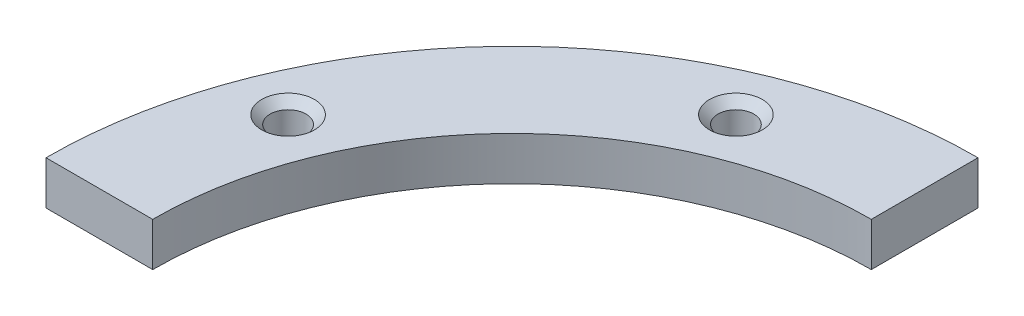
ISO-10303-21;
HEADER;
FILE_DESCRIPTION(('STEP AP214'),'2;1');
FILE_NAME('part.step','',(''),(''),'','','');
FILE_SCHEMA(('AUTOMOTIVE_DESIGN { 1 0 10303 214 1 1 1 1 }'));
ENDSEC;
DATA;
#1=APPLICATION_CONTEXT('core data for automotive mechanical design processes');
#2=APPLICATION_PROTOCOL_DEFINITION('international standard','automotive_design',2000,#1);
#3=PRODUCT_CONTEXT('',#1,'mechanical');
#4=PRODUCT('Part','Part','',(#3));
#5=PRODUCT_RELATED_PRODUCT_CATEGORY('part','',(#4));
#6=PRODUCT_DEFINITION_FORMATION('','',#4);
#7=PRODUCT_DEFINITION_CONTEXT('part definition',#1,'design');
#8=PRODUCT_DEFINITION('design','',#6,#7);
#9=PRODUCT_DEFINITION_SHAPE('','',#8);
#10=(LENGTH_UNIT() NAMED_UNIT(*) SI_UNIT(.MILLI.,.METRE.));
#11=(NAMED_UNIT(*) PLANE_ANGLE_UNIT() SI_UNIT($,.RADIAN.));
#12=(NAMED_UNIT(*) SI_UNIT($,.STERADIAN.) SOLID_ANGLE_UNIT());
#13=UNCERTAINTY_MEASURE_WITH_UNIT(LENGTH_MEASURE(1.E-05),#10,'distance_accuracy_value','');
#14=(GEOMETRIC_REPRESENTATION_CONTEXT(3) GLOBAL_UNCERTAINTY_ASSIGNED_CONTEXT((#13)) GLOBAL_UNIT_ASSIGNED_CONTEXT((#10,
#11,#12)) REPRESENTATION_CONTEXT('',''));
#15=CARTESIAN_POINT('',(0.,0.,0.));
#16=DIRECTION('',(0.,0.,1.));
#17=DIRECTION('',(1.,0.,0.));
#18=AXIS2_PLACEMENT_3D('',#15,#16,#17);
#19=CARTESIAN_POINT('',(0.,4.,0.));
#20=DIRECTION('',(0.,-1.,0.));
#21=DIRECTION('',(0.,0.,-1.));
#22=AXIS2_PLACEMENT_3D('',#19,#20,#21);
#23=CYLINDRICAL_SURFACE('',#22,33.);
#24=CARTESIAN_POINT('',(0.,0.,0.));
#25=DIRECTION('',(0.,-1.,0.));
#26=DIRECTION('',(0.,0.,-1.));
#27=AXIS2_PLACEMENT_3D('',#24,#25,#26);
#28=CIRCLE('',#27,33.);
#29=CARTESIAN_POINT('',(-33.,0.,0.));
#30=VERTEX_POINT('',#29);
#31=CARTESIAN_POINT('',(-1.23301553056196E-13,0.,-33.));
#32=VERTEX_POINT('',#31);
#33=EDGE_CURVE('E107',#30,#32,#28,.T.);
#34=ORIENTED_EDGE('',*,*,#33,.T.);
#35=DIRECTION('',(0.,-1.,0.));
#36=VECTOR('',#35,1.);
#37=CARTESIAN_POINT('',(-1.23301553056196E-13,4.,-33.));
#38=LINE('',#37,#36);
#39=CARTESIAN_POINT('',(-1.23301553056196E-13,4.,-33.));
#40=VERTEX_POINT('',#39);
#41=EDGE_CURVE('E11',#40,#32,#38,.T.);
#42=ORIENTED_EDGE('',*,*,#41,.F.);
#43=CARTESIAN_POINT('',(0.,4.,0.));
#44=DIRECTION('',(0.,-1.,0.));
#45=DIRECTION('',(0.,0.,-1.));
#46=AXIS2_PLACEMENT_3D('',#43,#44,#45);
#47=CIRCLE('',#46,33.);
#48=CARTESIAN_POINT('',(-33.,4.,0.));
#49=VERTEX_POINT('',#48);
#50=EDGE_CURVE('E95',#49,#40,#47,.T.);
#51=ORIENTED_EDGE('',*,*,#50,.F.);
#52=DIRECTION('',(0.,-1.,0.));
#53=VECTOR('',#52,1.);
#54=CARTESIAN_POINT('',(-33.,4.,0.));
#55=LINE('',#54,#53);
#56=EDGE_CURVE('E103',#49,#30,#55,.T.);
#57=ORIENTED_EDGE('',*,*,#56,.T.);
#58=EDGE_LOOP('',(#34,#42,#51,#57));
#59=FACE_BOUND('',#58,.T.);
#60=ADVANCED_FACE('F44',(#59),#23,.F.);
#61=CARTESIAN_POINT('',(-1.23301553056196E-13,4.,-33.));
#62=DIRECTION('',(-1.,0.,0.));
#63=DIRECTION('',(0.,0.,1.));
#64=AXIS2_PLACEMENT_3D('',#61,#62,#63);
#65=PLANE('',#64);
#66=DIRECTION('',(0.,0.,-1.));
#67=VECTOR('',#66,1.);
#68=CARTESIAN_POINT('',(-1.23301553056196E-13,0.,-33.));
#69=LINE('',#68,#67);
#70=CARTESIAN_POINT('',(0.,0.,-42.8));
#71=VERTEX_POINT('',#70);
#72=EDGE_CURVE('E99',#32,#71,#69,.T.);
#73=ORIENTED_EDGE('',*,*,#72,.T.);
#74=DIRECTION('',(0.,-1.,0.));
#75=VECTOR('',#74,1.);
#76=CARTESIAN_POINT('',(0.,4.,-42.8));
#77=LINE('',#76,#75);
#78=CARTESIAN_POINT('',(0.,4.,-42.8));
#79=VERTEX_POINT('',#78);
#80=EDGE_CURVE('E52',#79,#71,#77,.T.);
#81=ORIENTED_EDGE('',*,*,#80,.F.);
#82=DIRECTION('',(0.,0.,-1.));
#83=VECTOR('',#82,1.);
#84=CARTESIAN_POINT('',(-1.23301553056196E-13,4.,-33.));
#85=LINE('',#84,#83);
#86=EDGE_CURVE('E90',#40,#79,#85,.T.);
#87=ORIENTED_EDGE('',*,*,#86,.F.);
#88=ORIENTED_EDGE('',*,*,#41,.T.);
#89=EDGE_LOOP('',(#73,#81,#87,#88));
#90=FACE_BOUND('',#89,.T.);
#91=ADVANCED_FACE('F98',(#90),#65,.F.);
#92=CARTESIAN_POINT('',(0.,4.,0.));
#93=DIRECTION('',(0.,-1.,0.));
#94=DIRECTION('',(0.,0.,-1.));
#95=AXIS2_PLACEMENT_3D('',#92,#93,#94);
#96=CYLINDRICAL_SURFACE('',#95,42.8);
#97=CARTESIAN_POINT('',(0.,0.,0.));
#98=DIRECTION('',(0.,1.,0.));
#99=DIRECTION('',(0.,0.,-1.));
#100=AXIS2_PLACEMENT_3D('',#97,#98,#99);
#101=CIRCLE('',#100,42.8);
#102=CARTESIAN_POINT('',(-42.8,0.,0.));
#103=VERTEX_POINT('',#102);
#104=EDGE_CURVE('E77',#71,#103,#101,.T.);
#105=ORIENTED_EDGE('',*,*,#104,.T.);
#106=DIRECTION('',(0.,-1.,0.));
#107=VECTOR('',#106,1.);
#108=CARTESIAN_POINT('',(-42.8,4.,0.));
#109=LINE('',#108,#107);
#110=CARTESIAN_POINT('',(-42.8,4.,0.));
#111=VERTEX_POINT('',#110);
#112=EDGE_CURVE('E100',#111,#103,#109,.T.);
#113=ORIENTED_EDGE('',*,*,#112,.F.);
#114=CARTESIAN_POINT('',(0.,4.,0.));
#115=DIRECTION('',(0.,1.,0.));
#116=DIRECTION('',(0.,0.,-1.));
#117=AXIS2_PLACEMENT_3D('',#114,#115,#116);
#118=CIRCLE('',#117,42.8);
#119=EDGE_CURVE('E93',#79,#111,#118,.T.);
#120=ORIENTED_EDGE('',*,*,#119,.F.);
#121=ORIENTED_EDGE('',*,*,#80,.T.);
#122=EDGE_LOOP('',(#105,#113,#120,#121));
#123=FACE_BOUND('',#122,.T.);
#124=ADVANCED_FACE('F101',(#123),#96,.T.);
#125=CARTESIAN_POINT('',(-33.,4.,0.));
#126=DIRECTION('',(0.,0.,-1.));
#127=DIRECTION('',(-1.,0.,0.));
#128=AXIS2_PLACEMENT_3D('',#125,#126,#127);
#129=PLANE('',#128);
#130=DIRECTION('',(1.,0.,0.));
#131=VECTOR('',#130,1.);
#132=CARTESIAN_POINT('',(-33.,0.,0.));
#133=LINE('',#132,#131);
#134=EDGE_CURVE('E83',#103,#30,#133,.T.);
#135=ORIENTED_EDGE('',*,*,#134,.T.);
#136=ORIENTED_EDGE('',*,*,#56,.F.);
#137=DIRECTION('',(1.,0.,0.));
#138=VECTOR('',#137,1.);
#139=CARTESIAN_POINT('',(-33.,4.,0.));
#140=LINE('',#139,#138);
#141=EDGE_CURVE('E60',#111,#49,#140,.T.);
#142=ORIENTED_EDGE('',*,*,#141,.F.);
#143=ORIENTED_EDGE('',*,*,#112,.T.);
#144=EDGE_LOOP('',(#135,#136,#142,#143));
#145=FACE_BOUND('',#144,.T.);
#146=ADVANCED_FACE('F115',(#145),#129,.F.);
#147=CARTESIAN_POINT('',(0.,4.,0.));
#148=DIRECTION('',(0.,-1.,0.));
#149=DIRECTION('',(0.,0.,-1.));
#150=AXIS2_PLACEMENT_3D('',#147,#148,#149);
#151=PLANE('',#150);
#152=CARTESIAN_POINT('',(-14.5419704298741,4.,-35.1074222354286));
#153=DIRECTION('',(0.,1.,0.));
#154=DIRECTION('',(0.,0.,1.));
#155=AXIS2_PLACEMENT_3D('',#152,#153,#154);
#156=CIRCLE('',#155,2.425);
#157=CARTESIAN_POINT('',(-14.5419704298741,4.,-32.6824222354286));
#158=VERTEX_POINT('',#157);
#159=EDGE_CURVE('E135',#158,#158,#156,.T.);
#160=ORIENTED_EDGE('',*,*,#159,.F.);
#161=EDGE_LOOP('',(#160));
#162=FACE_BOUND('',#161,.T.);
#163=CARTESIAN_POINT('',(-35.107422235429,4.,-14.5419704298732));
#164=DIRECTION('',(0.,1.,0.));
#165=DIRECTION('',(0.,0.,1.));
#166=AXIS2_PLACEMENT_3D('',#163,#164,#165);
#167=CIRCLE('',#166,2.425);
#168=CARTESIAN_POINT('',(-35.107422235429,4.,-12.1169704298732));
#169=VERTEX_POINT('',#168);
#170=EDGE_CURVE('E126',#169,#169,#167,.T.);
#171=ORIENTED_EDGE('',*,*,#170,.F.);
#172=EDGE_LOOP('',(#171));
#173=FACE_BOUND('',#172,.T.);
#174=ORIENTED_EDGE('',*,*,#50,.T.);
#175=ORIENTED_EDGE('',*,*,#86,.T.);
#176=ORIENTED_EDGE('',*,*,#119,.T.);
#177=ORIENTED_EDGE('',*,*,#141,.T.);
#178=EDGE_LOOP('',(#174,#175,#176,#177));
#179=FACE_BOUND('',#178,.T.);
#180=ADVANCED_FACE('F91',(#162,#173,#179),#151,.F.);
#181=CARTESIAN_POINT('',(0.,0.,0.));
#182=DIRECTION('',(0.,-1.,0.));
#183=DIRECTION('',(0.,0.,-1.));
#184=AXIS2_PLACEMENT_3D('',#181,#182,#183);
#185=PLANE('',#184);
#186=CARTESIAN_POINT('',(-14.5419704298741,0.,-35.1074222354286));
#187=DIRECTION('',(0.,1.,0.));
#188=DIRECTION('',(0.,0.,1.));
#189=AXIS2_PLACEMENT_3D('',#186,#187,#188);
#190=CIRCLE('',#189,1.65);
#191=CARTESIAN_POINT('',(-14.5419704298741,0.,-33.4574222354286));
#192=VERTEX_POINT('',#191);
#193=EDGE_CURVE('E129',#192,#192,#190,.T.);
#194=ORIENTED_EDGE('',*,*,#193,.T.);
#195=EDGE_LOOP('',(#194));
#196=FACE_BOUND('',#195,.T.);
#197=CARTESIAN_POINT('',(-35.107422235429,0.,-14.5419704298732));
#198=DIRECTION('',(0.,1.,0.));
#199=DIRECTION('',(0.,0.,1.));
#200=AXIS2_PLACEMENT_3D('',#197,#198,#199);
#201=CIRCLE('',#200,1.65);
#202=CARTESIAN_POINT('',(-35.107422235429,0.,-12.8919704298732));
#203=VERTEX_POINT('',#202);
#204=EDGE_CURVE('E110',#203,#203,#201,.T.);
#205=ORIENTED_EDGE('',*,*,#204,.T.);
#206=EDGE_LOOP('',(#205));
#207=FACE_BOUND('',#206,.T.);
#208=ORIENTED_EDGE('',*,*,#33,.F.);
#209=ORIENTED_EDGE('',*,*,#134,.F.);
#210=ORIENTED_EDGE('',*,*,#104,.F.);
#211=ORIENTED_EDGE('',*,*,#72,.F.);
#212=EDGE_LOOP('',(#208,#209,#210,#211));
#213=FACE_BOUND('',#212,.T.);
#214=ADVANCED_FACE('F118',(#196,#207,#213),#185,.T.);
#215=CARTESIAN_POINT('',(-35.107422235429,4.,-14.5419704298732));
#216=DIRECTION('',(0.,1.,0.));
#217=DIRECTION('',(0.,0.,1.));
#218=AXIS2_PLACEMENT_3D('',#215,#216,#217);
#219=CYLINDRICAL_SURFACE('',#218,1.65);
#220=ORIENTED_EDGE('',*,*,#204,.F.);
#221=EDGE_LOOP('',(#220));
#222=FACE_BOUND('',#221,.T.);
#223=CARTESIAN_POINT('',(-35.107422235429,3.225,-14.5419704298732));
#224=DIRECTION('',(0.,1.,0.));
#225=DIRECTION('',(0.,0.,1.));
#226=AXIS2_PLACEMENT_3D('',#223,#224,#225);
#227=CIRCLE('',#226,1.65);
#228=CARTESIAN_POINT('',(-35.107422235429,3.225,-12.8919704298732));
#229=VERTEX_POINT('',#228);
#230=EDGE_CURVE('E123',#229,#229,#227,.T.);
#231=ORIENTED_EDGE('',*,*,#230,.T.);
#232=EDGE_LOOP('',(#231));
#233=FACE_BOUND('',#232,.T.);
#234=ADVANCED_FACE('F149',(#222,#233),#219,.F.);
#235=CARTESIAN_POINT('',(-35.107422235429,4.,-14.5419704298732));
#236=DIRECTION('',(0.,1.,0.));
#237=DIRECTION('',(0.,0.,1.));
#238=AXIS2_PLACEMENT_3D('',#235,#236,#237);
#239=CONICAL_SURFACE('',#238,2.425,0.785398163397445);
#240=ORIENTED_EDGE('',*,*,#230,.F.);
#241=EDGE_LOOP('',(#240));
#242=FACE_BOUND('',#241,.T.);
#243=ORIENTED_EDGE('',*,*,#170,.T.);
#244=EDGE_LOOP('',(#243));
#245=FACE_BOUND('',#244,.T.);
#246=ADVANCED_FACE('F146',(#242,#245),#239,.F.);
#247=CARTESIAN_POINT('',(-14.5419704298741,4.,-35.1074222354286));
#248=DIRECTION('',(0.,1.,0.));
#249=DIRECTION('',(0.,0.,1.));
#250=AXIS2_PLACEMENT_3D('',#247,#248,#249);
#251=CYLINDRICAL_SURFACE('',#250,1.65);
#252=ORIENTED_EDGE('',*,*,#193,.F.);
#253=EDGE_LOOP('',(#252));
#254=FACE_BOUND('',#253,.T.);
#255=CARTESIAN_POINT('',(-14.5419704298741,3.225,-35.1074222354286));
#256=DIRECTION('',(0.,1.,0.));
#257=DIRECTION('',(0.,0.,1.));
#258=AXIS2_PLACEMENT_3D('',#255,#256,#257);
#259=CIRCLE('',#258,1.65);
#260=CARTESIAN_POINT('',(-14.5419704298741,3.225,-33.4574222354286));
#261=VERTEX_POINT('',#260);
#262=EDGE_CURVE('E132',#261,#261,#259,.T.);
#263=ORIENTED_EDGE('',*,*,#262,.T.);
#264=EDGE_LOOP('',(#263));
#265=FACE_BOUND('',#264,.T.);
#266=ADVANCED_FACE('F148',(#254,#265),#251,.F.);
#267=CARTESIAN_POINT('',(-14.5419704298741,4.,-35.1074222354286));
#268=DIRECTION('',(0.,1.,0.));
#269=DIRECTION('',(0.,0.,1.));
#270=AXIS2_PLACEMENT_3D('',#267,#268,#269);
#271=CONICAL_SURFACE('',#270,2.425,0.785398163397448);
#272=ORIENTED_EDGE('',*,*,#262,.F.);
#273=EDGE_LOOP('',(#272));
#274=FACE_BOUND('',#273,.T.);
#275=ORIENTED_EDGE('',*,*,#159,.T.);
#276=EDGE_LOOP('',(#275));
#277=FACE_BOUND('',#276,.T.);
#278=ADVANCED_FACE('F139',(#274,#277),#271,.F.);
#279=CLOSED_SHELL('',(#60,#91,#124,#146,#180,#214,#234,#246,#266,#278));
#280=MANIFOLD_SOLID_BREP('B2',#279);
#281=ADVANCED_BREP_SHAPE_REPRESENTATION('',(#18,#280),#14);
#282=SHAPE_DEFINITION_REPRESENTATION(#9,#281);
ENDSEC;
END-ISO-10303-21;
